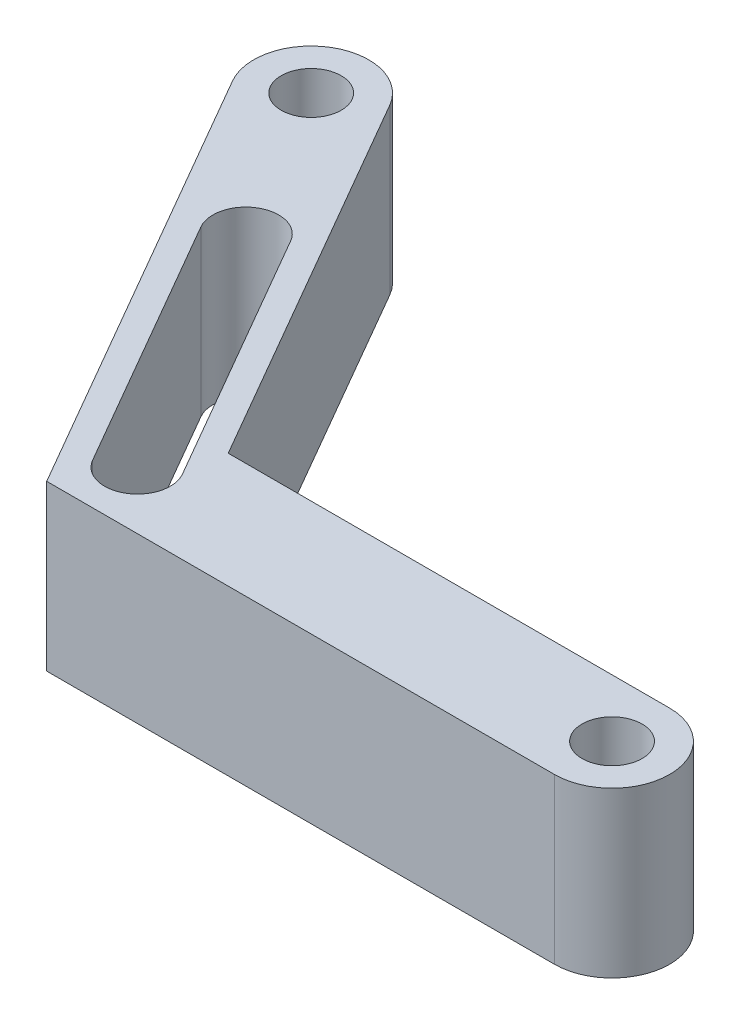
ISO-10303-21;
HEADER;
FILE_DESCRIPTION(('STEP AP214'),'2;1');
FILE_NAME('part.step','',(''),(''),'','','');
FILE_SCHEMA(('AUTOMOTIVE_DESIGN { 1 0 10303 214 1 1 1 1 }'));
ENDSEC;
DATA;
#1=APPLICATION_CONTEXT('core data for automotive mechanical design processes');
#2=APPLICATION_PROTOCOL_DEFINITION('international standard','automotive_design',2000,#1);
#3=PRODUCT_CONTEXT('',#1,'mechanical');
#4=PRODUCT('Part','Part','',(#3));
#5=PRODUCT_RELATED_PRODUCT_CATEGORY('part','',(#4));
#6=PRODUCT_DEFINITION_FORMATION('','',#4);
#7=PRODUCT_DEFINITION_CONTEXT('part definition',#1,'design');
#8=PRODUCT_DEFINITION('design','',#6,#7);
#9=PRODUCT_DEFINITION_SHAPE('','',#8);
#10=(LENGTH_UNIT() NAMED_UNIT(*) SI_UNIT(.MILLI.,.METRE.));
#11=(NAMED_UNIT(*) PLANE_ANGLE_UNIT() SI_UNIT($,.RADIAN.));
#12=(NAMED_UNIT(*) SI_UNIT($,.STERADIAN.) SOLID_ANGLE_UNIT());
#13=UNCERTAINTY_MEASURE_WITH_UNIT(LENGTH_MEASURE(1.E-05),#10,'distance_accuracy_value','');
#14=(GEOMETRIC_REPRESENTATION_CONTEXT(3) GLOBAL_UNCERTAINTY_ASSIGNED_CONTEXT((#13)) GLOBAL_UNIT_ASSIGNED_CONTEXT((#10,
#11,#12)) REPRESENTATION_CONTEXT('',''));
#15=CARTESIAN_POINT('',(0.,0.,0.));
#16=DIRECTION('',(0.,0.,1.));
#17=DIRECTION('',(1.,0.,0.));
#18=AXIS2_PLACEMENT_3D('',#15,#16,#17);
#19=CARTESIAN_POINT('',(0.,10.,0.));
#20=DIRECTION('',(0.,-1.,0.));
#21=DIRECTION('',(0.,0.,-1.));
#22=AXIS2_PLACEMENT_3D('',#19,#20,#21);
#23=PLANE('',#22);
#24=DIRECTION('',(0.5,0.,0.866025403784439));
#25=VECTOR('',#24,1.);
#26=CARTESIAN_POINT('',(-39.5995642670501,10.,-14.5884572681199));
#27=LINE('',#26,#25);
#28=CARTESIAN_POINT('',(-39.5995642670501,10.,-14.5884572681199));
#29=VERTEX_POINT('',#28);
#30=CARTESIAN_POINT('',(-30.5995642670501,10.,0.999999999999997));
#31=VERTEX_POINT('',#30);
#32=EDGE_CURVE('E141',#29,#31,#27,.T.);
#33=ORIENTED_EDGE('',*,*,#32,.F.);
#34=CARTESIAN_POINT('',(-37.8675134594813,10.,-15.5884572681199));
#35=DIRECTION('',(0.,1.,0.));
#36=DIRECTION('',(0.,0.,1.));
#37=AXIS2_PLACEMENT_3D('',#34,#35,#36);
#38=CIRCLE('',#37,1.99999999999999);
#39=CARTESIAN_POINT('',(-36.1354626519124,10.,-16.5884572681199));
#40=VERTEX_POINT('',#39);
#41=EDGE_CURVE('E52',#40,#29,#38,.T.);
#42=ORIENTED_EDGE('',*,*,#41,.F.);
#43=DIRECTION('',(-0.5,0.,-0.866025403784439));
#44=VECTOR('',#43,1.);
#45=CARTESIAN_POINT('',(-36.1354626519124,10.,-16.5884572681199));
#46=LINE('',#45,#44);
#47=CARTESIAN_POINT('',(-27.1354626519124,10.,-0.999999999999998));
#48=VERTEX_POINT('',#47);
#49=EDGE_CURVE('E132',#48,#40,#46,.T.);
#50=ORIENTED_EDGE('',*,*,#49,.F.);
#51=CARTESIAN_POINT('',(-28.8675134594813,10.,0.));
#52=DIRECTION('',(0.,1.,0.));
#53=DIRECTION('',(0.,0.,1.));
#54=AXIS2_PLACEMENT_3D('',#51,#52,#53);
#55=CIRCLE('',#54,1.99999999999999);
#56=EDGE_CURVE('E135',#31,#48,#55,.T.);
#57=ORIENTED_EDGE('',*,*,#56,.F.);
#58=EDGE_LOOP('',(#33,#42,#50,#57));
#59=FACE_BOUND('',#58,.T.);
#60=CARTESIAN_POINT('',(0.,10.,0.));
#61=DIRECTION('',(0.,1.,0.));
#62=DIRECTION('',(0.,0.,-1.));
#63=AXIS2_PLACEMENT_3D('',#60,#61,#62);
#64=CIRCLE('',#63,3.5);
#65=CARTESIAN_POINT('',(0.,10.,3.5));
#66=VERTEX_POINT('',#65);
#67=CARTESIAN_POINT('',(0.,10.,-3.5));
#68=VERTEX_POINT('',#67);
#69=EDGE_CURVE('E163',#66,#68,#64,.T.);
#70=ORIENTED_EDGE('',*,*,#69,.T.);
#71=DIRECTION('',(-1.,0.,0.));
#72=VECTOR('',#71,1.);
#73=CARTESIAN_POINT('',(0.,10.,-3.5));
#74=LINE('',#73,#72);
#75=CARTESIAN_POINT('',(-26.8467875173176,10.,-3.5));
#76=VERTEX_POINT('',#75);
#77=EDGE_CURVE('E166',#68,#76,#74,.T.);
#78=ORIENTED_EDGE('',*,*,#77,.T.);
#79=DIRECTION('',(-0.499999999999999,0.,-0.866025403784439));
#80=VECTOR('',#79,1.);
#81=CARTESIAN_POINT('',(-26.8467875173176,10.,-3.5));
#82=LINE('',#81,#80);
#83=CARTESIAN_POINT('',(-40.2701812759764,10.,-26.75));
#84=VERTEX_POINT('',#83);
#85=EDGE_CURVE('E169',#76,#84,#82,.T.);
#86=ORIENTED_EDGE('',*,*,#85,.T.);
#87=CARTESIAN_POINT('',(-43.3012701892219,10.,-25.));
#88=DIRECTION('',(0.,1.,0.));
#89=DIRECTION('',(0.,0.,1.));
#90=AXIS2_PLACEMENT_3D('',#87,#88,#89);
#91=CIRCLE('',#90,3.5);
#92=CARTESIAN_POINT('',(-46.3323591024675,10.,-23.2500000000001));
#93=VERTEX_POINT('',#92);
#94=EDGE_CURVE('E171',#84,#93,#91,.T.);
#95=ORIENTED_EDGE('',*,*,#94,.T.);
#96=DIRECTION('',(0.499999999999998,0.,0.866025403784439));
#97=VECTOR('',#96,1.);
#98=CARTESIAN_POINT('',(-46.3323591024675,10.,-23.2500000000001));
#99=LINE('',#98,#97);
#100=CARTESIAN_POINT('',(-30.888239401645,10.,3.5));
#101=VERTEX_POINT('',#100);
#102=EDGE_CURVE('E173',#93,#101,#99,.T.);
#103=ORIENTED_EDGE('',*,*,#102,.T.);
#104=DIRECTION('',(1.,0.,0.));
#105=VECTOR('',#104,1.);
#106=CARTESIAN_POINT('',(-30.888239401645,10.,3.5));
#107=LINE('',#106,#105);
#108=EDGE_CURVE('E175',#101,#66,#107,.T.);
#109=ORIENTED_EDGE('',*,*,#108,.T.);
#110=EDGE_LOOP('',(#70,#78,#86,#95,#103,#109));
#111=FACE_BOUND('',#110,.T.);
#112=CARTESIAN_POINT('',(0.,10.,0.));
#113=DIRECTION('',(0.,1.,0.));
#114=DIRECTION('',(0.,0.,1.));
#115=AXIS2_PLACEMENT_3D('',#112,#113,#114);
#116=CIRCLE('',#115,1.825);
#117=CARTESIAN_POINT('',(0.,10.,1.825));
#118=VERTEX_POINT('',#117);
#119=EDGE_CURVE('E157',#118,#118,#116,.T.);
#120=ORIENTED_EDGE('',*,*,#119,.F.);
#121=EDGE_LOOP('',(#120));
#122=FACE_BOUND('',#121,.T.);
#123=CARTESIAN_POINT('',(-43.3012701892219,10.,-25.));
#124=DIRECTION('',(0.,1.,0.));
#125=DIRECTION('',(0.,0.,1.));
#126=AXIS2_PLACEMENT_3D('',#123,#124,#125);
#127=CIRCLE('',#126,1.825);
#128=CARTESIAN_POINT('',(-43.3012701892219,10.,-23.175));
#129=VERTEX_POINT('',#128);
#130=EDGE_CURVE('E151',#129,#129,#127,.T.);
#131=ORIENTED_EDGE('',*,*,#130,.F.);
#132=EDGE_LOOP('',(#131));
#133=FACE_BOUND('',#132,.T.);
#134=ADVANCED_FACE('F37',(#59,#111,#122,#133),#23,.F.);
#135=CARTESIAN_POINT('',(0.,0.,0.));
#136=DIRECTION('',(0.,-1.,0.));
#137=DIRECTION('',(0.,0.,-1.));
#138=AXIS2_PLACEMENT_3D('',#135,#136,#137);
#139=PLANE('',#138);
#140=CARTESIAN_POINT('',(-37.8675134594813,0.,-15.5884572681199));
#141=DIRECTION('',(0.,1.,0.));
#142=DIRECTION('',(0.,0.,1.));
#143=AXIS2_PLACEMENT_3D('',#140,#141,#142);
#144=CIRCLE('',#143,1.99999999999999);
#145=CARTESIAN_POINT('',(-36.1354626519124,0.,-16.5884572681199));
#146=VERTEX_POINT('',#145);
#147=CARTESIAN_POINT('',(-39.5995642670501,0.,-14.5884572681199));
#148=VERTEX_POINT('',#147);
#149=EDGE_CURVE('E116',#146,#148,#144,.T.);
#150=ORIENTED_EDGE('',*,*,#149,.T.);
#151=DIRECTION('',(0.5,0.,0.866025403784439));
#152=VECTOR('',#151,1.);
#153=CARTESIAN_POINT('',(-39.5995642670501,0.,-14.5884572681199));
#154=LINE('',#153,#152);
#155=CARTESIAN_POINT('',(-30.5995642670501,0.,0.999999999999996));
#156=VERTEX_POINT('',#155);
#157=EDGE_CURVE('E125',#148,#156,#154,.T.);
#158=ORIENTED_EDGE('',*,*,#157,.T.);
#159=CARTESIAN_POINT('',(-28.8675134594813,0.,0.));
#160=DIRECTION('',(0.,1.,0.));
#161=DIRECTION('',(0.,0.,1.));
#162=AXIS2_PLACEMENT_3D('',#159,#160,#161);
#163=CIRCLE('',#162,1.99999999999999);
#164=CARTESIAN_POINT('',(-27.1354626519124,0.,-0.999999999999998));
#165=VERTEX_POINT('',#164);
#166=EDGE_CURVE('E60',#156,#165,#163,.T.);
#167=ORIENTED_EDGE('',*,*,#166,.T.);
#168=DIRECTION('',(-0.5,0.,-0.866025403784439));
#169=VECTOR('',#168,1.);
#170=CARTESIAN_POINT('',(-36.1354626519124,0.,-16.5884572681199));
#171=LINE('',#170,#169);
#172=EDGE_CURVE('E122',#165,#146,#171,.T.);
#173=ORIENTED_EDGE('',*,*,#172,.T.);
#174=EDGE_LOOP('',(#150,#158,#167,#173));
#175=FACE_BOUND('',#174,.T.);
#176=CARTESIAN_POINT('',(0.,0.,0.));
#177=DIRECTION('',(0.,1.,0.));
#178=DIRECTION('',(0.,0.,1.));
#179=AXIS2_PLACEMENT_3D('',#176,#177,#178);
#180=CIRCLE('',#179,1.825);
#181=CARTESIAN_POINT('',(0.,0.,1.825));
#182=VERTEX_POINT('',#181);
#183=EDGE_CURVE('E154',#182,#182,#180,.T.);
#184=ORIENTED_EDGE('',*,*,#183,.T.);
#185=EDGE_LOOP('',(#184));
#186=FACE_BOUND('',#185,.T.);
#187=CARTESIAN_POINT('',(0.,0.,0.));
#188=DIRECTION('',(0.,1.,0.));
#189=DIRECTION('',(0.,0.,-1.));
#190=AXIS2_PLACEMENT_3D('',#187,#188,#189);
#191=CIRCLE('',#190,3.5);
#192=CARTESIAN_POINT('',(0.,0.,3.5));
#193=VERTEX_POINT('',#192);
#194=CARTESIAN_POINT('',(0.,0.,-3.5));
#195=VERTEX_POINT('',#194);
#196=EDGE_CURVE('E160',#193,#195,#191,.T.);
#197=ORIENTED_EDGE('',*,*,#196,.F.);
#198=DIRECTION('',(1.,0.,0.));
#199=VECTOR('',#198,1.);
#200=CARTESIAN_POINT('',(-30.888239401645,0.,3.5));
#201=LINE('',#200,#199);
#202=CARTESIAN_POINT('',(-30.888239401645,0.,3.5));
#203=VERTEX_POINT('',#202);
#204=EDGE_CURVE('E167',#203,#193,#201,.T.);
#205=ORIENTED_EDGE('',*,*,#204,.F.);
#206=DIRECTION('',(0.499999999999998,0.,0.866025403784439));
#207=VECTOR('',#206,1.);
#208=CARTESIAN_POINT('',(-46.3323591024675,0.,-23.2500000000001));
#209=LINE('',#208,#207);
#210=CARTESIAN_POINT('',(-46.3323591024675,0.,-23.2500000000001));
#211=VERTEX_POINT('',#210);
#212=EDGE_CURVE('E186',#211,#203,#209,.T.);
#213=ORIENTED_EDGE('',*,*,#212,.F.);
#214=CARTESIAN_POINT('',(-43.3012701892219,0.,-25.));
#215=DIRECTION('',(0.,1.,0.));
#216=DIRECTION('',(0.,0.,1.));
#217=AXIS2_PLACEMENT_3D('',#214,#215,#216);
#218=CIRCLE('',#217,3.5);
#219=CARTESIAN_POINT('',(-40.2701812759764,0.,-26.75));
#220=VERTEX_POINT('',#219);
#221=EDGE_CURVE('E184',#220,#211,#218,.T.);
#222=ORIENTED_EDGE('',*,*,#221,.F.);
#223=DIRECTION('',(-0.499999999999999,0.,-0.866025403784439));
#224=VECTOR('',#223,1.);
#225=CARTESIAN_POINT('',(-26.8467875173176,0.,-3.5));
#226=LINE('',#225,#224);
#227=CARTESIAN_POINT('',(-26.8467875173176,0.,-3.5));
#228=VERTEX_POINT('',#227);
#229=EDGE_CURVE('E182',#228,#220,#226,.T.);
#230=ORIENTED_EDGE('',*,*,#229,.F.);
#231=DIRECTION('',(-1.,0.,0.));
#232=VECTOR('',#231,1.);
#233=CARTESIAN_POINT('',(0.,0.,-3.5));
#234=LINE('',#233,#232);
#235=EDGE_CURVE('E180',#195,#228,#234,.T.);
#236=ORIENTED_EDGE('',*,*,#235,.F.);
#237=EDGE_LOOP('',(#197,#205,#213,#222,#230,#236));
#238=FACE_BOUND('',#237,.T.);
#239=CARTESIAN_POINT('',(-43.3012701892219,0.,-25.));
#240=DIRECTION('',(0.,1.,0.));
#241=DIRECTION('',(0.,0.,1.));
#242=AXIS2_PLACEMENT_3D('',#239,#240,#241);
#243=CIRCLE('',#242,1.825);
#244=CARTESIAN_POINT('',(-43.3012701892219,0.,-23.175));
#245=VERTEX_POINT('',#244);
#246=EDGE_CURVE('E147',#245,#245,#243,.T.);
#247=ORIENTED_EDGE('',*,*,#246,.T.);
#248=EDGE_LOOP('',(#247));
#249=FACE_BOUND('',#248,.T.);
#250=ADVANCED_FACE('F129',(#175,#186,#238,#249),#139,.T.);
#251=CARTESIAN_POINT('',(0.,10.,0.));
#252=DIRECTION('',(0.,-1.,0.));
#253=DIRECTION('',(0.,0.,-1.));
#254=AXIS2_PLACEMENT_3D('',#251,#252,#253);
#255=CYLINDRICAL_SURFACE('',#254,3.5);
#256=ORIENTED_EDGE('',*,*,#196,.T.);
#257=DIRECTION('',(0.,-1.,0.));
#258=VECTOR('',#257,1.);
#259=CARTESIAN_POINT('',(0.,10.,-3.5));
#260=LINE('',#259,#258);
#261=EDGE_CURVE('E11',#68,#195,#260,.T.);
#262=ORIENTED_EDGE('',*,*,#261,.F.);
#263=ORIENTED_EDGE('',*,*,#69,.F.);
#264=DIRECTION('',(0.,-1.,0.));
#265=VECTOR('',#264,1.);
#266=CARTESIAN_POINT('',(0.,10.,3.5));
#267=LINE('',#266,#265);
#268=EDGE_CURVE('E177',#66,#193,#267,.T.);
#269=ORIENTED_EDGE('',*,*,#268,.T.);
#270=EDGE_LOOP('',(#256,#262,#263,#269));
#271=FACE_BOUND('',#270,.T.);
#272=ADVANCED_FACE('F39',(#271),#255,.T.);
#273=CARTESIAN_POINT('',(0.,10.,-3.5));
#274=DIRECTION('',(0.,0.,1.));
#275=DIRECTION('',(1.,0.,0.));
#276=AXIS2_PLACEMENT_3D('',#273,#274,#275);
#277=PLANE('',#276);
#278=ORIENTED_EDGE('',*,*,#235,.T.);
#279=DIRECTION('',(0.,-1.,0.));
#280=VECTOR('',#279,1.);
#281=CARTESIAN_POINT('',(-26.8467875173176,10.,-3.5));
#282=LINE('',#281,#280);
#283=EDGE_CURVE('E45',#76,#228,#282,.T.);
#284=ORIENTED_EDGE('',*,*,#283,.F.);
#285=ORIENTED_EDGE('',*,*,#77,.F.);
#286=ORIENTED_EDGE('',*,*,#261,.T.);
#287=EDGE_LOOP('',(#278,#284,#285,#286));
#288=FACE_BOUND('',#287,.T.);
#289=ADVANCED_FACE('F227',(#288),#277,.F.);
#290=CARTESIAN_POINT('',(-26.8467875173176,10.,-3.5));
#291=DIRECTION('',(-0.866025403784439,0.,0.499999999999999));
#292=DIRECTION('',(0.499999999999999,0.,0.866025403784439));
#293=AXIS2_PLACEMENT_3D('',#290,#291,#292);
#294=PLANE('',#293);
#295=ORIENTED_EDGE('',*,*,#229,.T.);
#296=DIRECTION('',(0.,-1.,0.));
#297=VECTOR('',#296,1.);
#298=CARTESIAN_POINT('',(-40.2701812759764,10.,-26.75));
#299=LINE('',#298,#297);
#300=EDGE_CURVE('E197',#84,#220,#299,.T.);
#301=ORIENTED_EDGE('',*,*,#300,.F.);
#302=ORIENTED_EDGE('',*,*,#85,.F.);
#303=ORIENTED_EDGE('',*,*,#283,.T.);
#304=EDGE_LOOP('',(#295,#301,#302,#303));
#305=FACE_BOUND('',#304,.T.);
#306=ADVANCED_FACE('F204',(#305),#294,.F.);
#307=CARTESIAN_POINT('',(-43.3012701892219,10.,-25.));
#308=DIRECTION('',(0.,-1.,0.));
#309=DIRECTION('',(0.,0.,-1.));
#310=AXIS2_PLACEMENT_3D('',#307,#308,#309);
#311=CYLINDRICAL_SURFACE('',#310,3.5);
#312=ORIENTED_EDGE('',*,*,#221,.T.);
#313=DIRECTION('',(0.,-1.,0.));
#314=VECTOR('',#313,1.);
#315=CARTESIAN_POINT('',(-46.3323591024675,10.,-23.2500000000001));
#316=LINE('',#315,#314);
#317=EDGE_CURVE('E194',#93,#211,#316,.T.);
#318=ORIENTED_EDGE('',*,*,#317,.F.);
#319=ORIENTED_EDGE('',*,*,#94,.F.);
#320=ORIENTED_EDGE('',*,*,#300,.T.);
#321=EDGE_LOOP('',(#312,#318,#319,#320));
#322=FACE_BOUND('',#321,.T.);
#323=ADVANCED_FACE('F215',(#322),#311,.T.);
#324=CARTESIAN_POINT('',(-46.3323591024675,10.,-23.2500000000001));
#325=DIRECTION('',(0.866025403784439,0.,-0.499999999999998));
#326=DIRECTION('',(-0.499999999999998,0.,-0.86602540378444));
#327=AXIS2_PLACEMENT_3D('',#324,#325,#326);
#328=PLANE('',#327);
#329=ORIENTED_EDGE('',*,*,#212,.T.);
#330=DIRECTION('',(0.,-1.,0.));
#331=VECTOR('',#330,1.);
#332=CARTESIAN_POINT('',(-30.888239401645,10.,3.5));
#333=LINE('',#332,#331);
#334=EDGE_CURVE('E191',#101,#203,#333,.T.);
#335=ORIENTED_EDGE('',*,*,#334,.F.);
#336=ORIENTED_EDGE('',*,*,#102,.F.);
#337=ORIENTED_EDGE('',*,*,#317,.T.);
#338=EDGE_LOOP('',(#329,#335,#336,#337));
#339=FACE_BOUND('',#338,.T.);
#340=ADVANCED_FACE('F219',(#339),#328,.F.);
#341=CARTESIAN_POINT('',(-30.888239401645,10.,3.5));
#342=DIRECTION('',(0.,0.,-1.));
#343=DIRECTION('',(-1.,0.,0.));
#344=AXIS2_PLACEMENT_3D('',#341,#342,#343);
#345=PLANE('',#344);
#346=ORIENTED_EDGE('',*,*,#204,.T.);
#347=ORIENTED_EDGE('',*,*,#268,.F.);
#348=ORIENTED_EDGE('',*,*,#108,.F.);
#349=ORIENTED_EDGE('',*,*,#334,.T.);
#350=EDGE_LOOP('',(#346,#347,#348,#349));
#351=FACE_BOUND('',#350,.T.);
#352=ADVANCED_FACE('F230',(#351),#345,.F.);
#353=CARTESIAN_POINT('',(0.,10.,0.));
#354=DIRECTION('',(0.,-1.,0.));
#355=DIRECTION('',(0.,0.,-1.));
#356=AXIS2_PLACEMENT_3D('',#353,#354,#355);
#357=CYLINDRICAL_SURFACE('',#356,1.825);
#358=ORIENTED_EDGE('',*,*,#119,.T.);
#359=EDGE_LOOP('',(#358));
#360=FACE_BOUND('',#359,.T.);
#361=ORIENTED_EDGE('',*,*,#183,.F.);
#362=EDGE_LOOP('',(#361));
#363=FACE_BOUND('',#362,.T.);
#364=ADVANCED_FACE('F232',(#360,#363),#357,.F.);
#365=CARTESIAN_POINT('',(-43.3012701892219,10.,-25.));
#366=DIRECTION('',(0.,-1.,0.));
#367=DIRECTION('',(0.,0.,-1.));
#368=AXIS2_PLACEMENT_3D('',#365,#366,#367);
#369=CYLINDRICAL_SURFACE('',#368,1.825);
#370=ORIENTED_EDGE('',*,*,#130,.T.);
#371=EDGE_LOOP('',(#370));
#372=FACE_BOUND('',#371,.T.);
#373=ORIENTED_EDGE('',*,*,#246,.F.);
#374=EDGE_LOOP('',(#373));
#375=FACE_BOUND('',#374,.T.);
#376=ADVANCED_FACE('F238',(#372,#375),#369,.F.);
#377=CARTESIAN_POINT('',(-37.8675134594813,0.,-15.5884572681199));
#378=DIRECTION('',(0.,1.,0.));
#379=DIRECTION('',(0.,0.,1.));
#380=AXIS2_PLACEMENT_3D('',#377,#378,#379);
#381=CYLINDRICAL_SURFACE('',#380,1.99999999999999);
#382=ORIENTED_EDGE('',*,*,#41,.T.);
#383=DIRECTION('',(0.,1.,0.));
#384=VECTOR('',#383,1.);
#385=CARTESIAN_POINT('',(-39.5995642670501,0.,-14.5884572681199));
#386=LINE('',#385,#384);
#387=EDGE_CURVE('E112',#148,#29,#386,.T.);
#388=ORIENTED_EDGE('',*,*,#387,.F.);
#389=ORIENTED_EDGE('',*,*,#149,.F.);
#390=DIRECTION('',(0.,1.,0.));
#391=VECTOR('',#390,1.);
#392=CARTESIAN_POINT('',(-36.1354626519124,0.,-16.5884572681199));
#393=LINE('',#392,#391);
#394=EDGE_CURVE('E145',#146,#40,#393,.T.);
#395=ORIENTED_EDGE('',*,*,#394,.T.);
#396=EDGE_LOOP('',(#382,#388,#389,#395));
#397=FACE_BOUND('',#396,.T.);
#398=ADVANCED_FACE('F114',(#397),#381,.F.);
#399=CARTESIAN_POINT('',(-36.1354626519124,0.,-16.5884572681199));
#400=DIRECTION('',(0.866025403784438,0.,-0.5));
#401=DIRECTION('',(-0.5,0.,-0.866025403784439));
#402=AXIS2_PLACEMENT_3D('',#399,#400,#401);
#403=PLANE('',#402);
#404=ORIENTED_EDGE('',*,*,#49,.T.);
#405=ORIENTED_EDGE('',*,*,#394,.F.);
#406=ORIENTED_EDGE('',*,*,#172,.F.);
#407=DIRECTION('',(0.,1.,0.));
#408=VECTOR('',#407,1.);
#409=CARTESIAN_POINT('',(-27.1354626519124,0.,-0.999999999999998));
#410=LINE('',#409,#408);
#411=EDGE_CURVE('E148',#165,#48,#410,.T.);
#412=ORIENTED_EDGE('',*,*,#411,.T.);
#413=EDGE_LOOP('',(#404,#405,#406,#412));
#414=FACE_BOUND('',#413,.T.);
#415=ADVANCED_FACE('F255',(#414),#403,.F.);
#416=CARTESIAN_POINT('',(-28.8675134594813,0.,0.));
#417=DIRECTION('',(0.,1.,0.));
#418=DIRECTION('',(0.,0.,1.));
#419=AXIS2_PLACEMENT_3D('',#416,#417,#418);
#420=CYLINDRICAL_SURFACE('',#419,1.99999999999999);
#421=ORIENTED_EDGE('',*,*,#56,.T.);
#422=ORIENTED_EDGE('',*,*,#411,.F.);
#423=ORIENTED_EDGE('',*,*,#166,.F.);
#424=DIRECTION('',(0.,1.,0.));
#425=VECTOR('',#424,1.);
#426=CARTESIAN_POINT('',(-30.5995642670501,0.,0.999999999999997));
#427=LINE('',#426,#425);
#428=EDGE_CURVE('E121',#156,#31,#427,.T.);
#429=ORIENTED_EDGE('',*,*,#428,.T.);
#430=EDGE_LOOP('',(#421,#422,#423,#429));
#431=FACE_BOUND('',#430,.T.);
#432=ADVANCED_FACE('F258',(#431),#420,.F.);
#433=CARTESIAN_POINT('',(-39.5995642670501,0.,-14.5884572681199));
#434=DIRECTION('',(-0.866025403784438,0.,0.5));
#435=DIRECTION('',(0.5,0.,0.866025403784439));
#436=AXIS2_PLACEMENT_3D('',#433,#434,#435);
#437=PLANE('',#436);
#438=ORIENTED_EDGE('',*,*,#32,.T.);
#439=ORIENTED_EDGE('',*,*,#428,.F.);
#440=ORIENTED_EDGE('',*,*,#157,.F.);
#441=ORIENTED_EDGE('',*,*,#387,.T.);
#442=EDGE_LOOP('',(#438,#439,#440,#441));
#443=FACE_BOUND('',#442,.T.);
#444=ADVANCED_FACE('F126',(#443),#437,.F.);
#445=CLOSED_SHELL('',(#134,#250,#272,#289,#306,#323,#340,#352,#364,#376,#398,#415,#432,#444));
#446=MANIFOLD_SOLID_BREP('B2',#445);
#447=ADVANCED_BREP_SHAPE_REPRESENTATION('',(#18,#446),#14);
#448=SHAPE_DEFINITION_REPRESENTATION(#9,#447);
ENDSEC;
END-ISO-10303-21;
